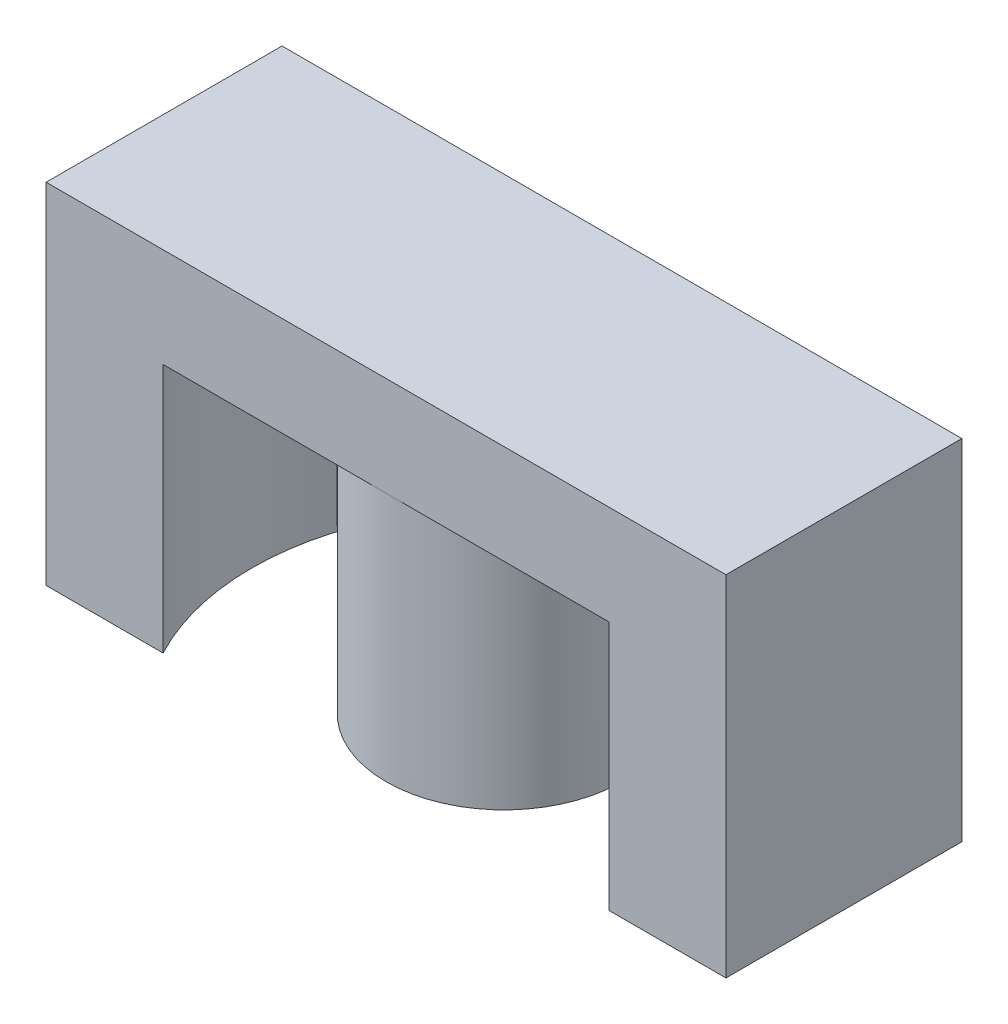
ISO-10303-21;
HEADER;
FILE_DESCRIPTION(('STEP AP214'),'2;1');
FILE_NAME('part.step','',(''),(''),'','','');
FILE_SCHEMA(('AUTOMOTIVE_DESIGN { 1 0 10303 214 1 1 1 1 }'));
ENDSEC;
DATA;
#1=APPLICATION_CONTEXT('core data for automotive mechanical design processes');
#2=APPLICATION_PROTOCOL_DEFINITION('international standard','automotive_design',2000,#1);
#3=PRODUCT_CONTEXT('',#1,'mechanical');
#4=PRODUCT('Part','Part','',(#3));
#5=PRODUCT_RELATED_PRODUCT_CATEGORY('part','',(#4));
#6=PRODUCT_DEFINITION_FORMATION('','',#4);
#7=PRODUCT_DEFINITION_CONTEXT('part definition',#1,'design');
#8=PRODUCT_DEFINITION('design','',#6,#7);
#9=PRODUCT_DEFINITION_SHAPE('','',#8);
#10=(LENGTH_UNIT() NAMED_UNIT(*) SI_UNIT(.MILLI.,.METRE.));
#11=(NAMED_UNIT(*) PLANE_ANGLE_UNIT() SI_UNIT($,.RADIAN.));
#12=(NAMED_UNIT(*) SI_UNIT($,.STERADIAN.) SOLID_ANGLE_UNIT());
#13=UNCERTAINTY_MEASURE_WITH_UNIT(LENGTH_MEASURE(1.E-05),#10,'distance_accuracy_value','');
#14=(GEOMETRIC_REPRESENTATION_CONTEXT(3) GLOBAL_UNCERTAINTY_ASSIGNED_CONTEXT((#13)) GLOBAL_UNIT_ASSIGNED_CONTEXT((#10,
#11,#12)) REPRESENTATION_CONTEXT('',''));
#15=CARTESIAN_POINT('',(0.,0.,0.));
#16=DIRECTION('',(0.,0.,1.));
#17=DIRECTION('',(1.,0.,0.));
#18=AXIS2_PLACEMENT_3D('',#15,#16,#17);
#19=CARTESIAN_POINT('',(0.,0.,22.4));
#20=DIRECTION('',(0.,1.,0.));
#21=DIRECTION('',(0.,0.,1.));
#22=AXIS2_PLACEMENT_3D('',#19,#20,#21);
#23=PLANE('',#22);
#24=CARTESIAN_POINT('',(0.,0.,22.4));
#25=DIRECTION('',(0.,1.,0.));
#26=DIRECTION('',(0.,0.,1.));
#27=AXIS2_PLACEMENT_3D('',#24,#25,#26);
#28=CIRCLE('',#27,7.6);
#29=CARTESIAN_POINT('',(0.,0.,30.));
#30=VERTEX_POINT('',#29);
#31=EDGE_CURVE('E20',#30,#30,#28,.T.);
#32=ORIENTED_EDGE('',*,*,#31,.F.);
#33=EDGE_LOOP('',(#32));
#34=FACE_BOUND('',#33,.T.);
#35=ADVANCED_FACE('F17',(#34),#23,.F.);
#36=CARTESIAN_POINT('',(0.,0.1,22.4));
#37=DIRECTION('',(0.,1.,0.));
#38=DIRECTION('',(0.,0.,1.));
#39=AXIS2_PLACEMENT_3D('',#36,#37,#38);
#40=CYLINDRICAL_SURFACE('',#39,7.6);
#41=ORIENTED_EDGE('',*,*,#31,.T.);
#42=EDGE_LOOP('',(#41));
#43=FACE_BOUND('',#42,.T.);
#44=CARTESIAN_POINT('',(0.,16.1,22.4));
#45=DIRECTION('',(0.,1.,0.));
#46=DIRECTION('',(0.,0.,1.));
#47=AXIS2_PLACEMENT_3D('',#44,#45,#46);
#48=CIRCLE('',#47,7.6);
#49=CARTESIAN_POINT('',(0.,16.1,14.8));
#50=VERTEX_POINT('',#49);
#51=CARTESIAN_POINT('',(0.,16.1,30.));
#52=VERTEX_POINT('',#51);
#53=EDGE_CURVE('E126',#50,#52,#48,.T.);
#54=ORIENTED_EDGE('',*,*,#53,.F.);
#55=CARTESIAN_POINT('',(0.,16.1,22.4));
#56=DIRECTION('',(0.,1.,0.));
#57=DIRECTION('',(0.,0.,1.));
#58=AXIS2_PLACEMENT_3D('',#55,#56,#57);
#59=CIRCLE('',#58,7.6);
#60=EDGE_CURVE('E128',#52,#50,#59,.T.);
#61=ORIENTED_EDGE('',*,*,#60,.F.);
#62=EDGE_LOOP('',(#54,#61));
#63=FACE_BOUND('',#62,.T.);
#64=ADVANCED_FACE('F197',(#43,#63),#40,.T.);
#65=CARTESIAN_POINT('',(0.,0.,22.4));
#66=DIRECTION('',(0.,1.,0.));
#67=DIRECTION('',(0.,0.,1.));
#68=AXIS2_PLACEMENT_3D('',#65,#66,#67);
#69=PLANE('',#68);
#70=DIRECTION('',(0.,0.,1.));
#71=VECTOR('',#70,1.);
#72=CARTESIAN_POINT('',(-21.9,0.,30.));
#73=LINE('',#72,#71);
#74=CARTESIAN_POINT('',(-21.9,0.,14.8));
#75=VERTEX_POINT('',#74);
#76=CARTESIAN_POINT('',(-21.9,0.,30.));
#77=VERTEX_POINT('',#76);
#78=EDGE_CURVE('E103',#75,#77,#73,.T.);
#79=ORIENTED_EDGE('',*,*,#78,.F.);
#80=DIRECTION('',(1.,0.,0.));
#81=VECTOR('',#80,1.);
#82=CARTESIAN_POINT('',(-21.9,0.,14.8));
#83=LINE('',#82,#81);
#84=CARTESIAN_POINT('',(-14.3632343154309,0.,14.8));
#85=VERTEX_POINT('',#84);
#86=EDGE_CURVE('E167',#85,#75,#83,.F.);
#87=ORIENTED_EDGE('',*,*,#86,.F.);
#88=CARTESIAN_POINT('',(0.,0.,22.4));
#89=DIRECTION('',(0.,1.,0.));
#90=DIRECTION('',(0.,0.,1.));
#91=AXIS2_PLACEMENT_3D('',#88,#89,#90);
#92=CIRCLE('',#91,16.25);
#93=CARTESIAN_POINT('',(-14.3632343154309,0.,30.));
#94=VERTEX_POINT('',#93);
#95=EDGE_CURVE('E112',#85,#94,#92,.T.);
#96=ORIENTED_EDGE('',*,*,#95,.T.);
#97=DIRECTION('',(1.,0.,0.));
#98=VECTOR('',#97,1.);
#99=CARTESIAN_POINT('',(-21.9,0.,30.));
#100=LINE('',#99,#98);
#101=EDGE_CURVE('E110',#77,#94,#100,.T.);
#102=ORIENTED_EDGE('',*,*,#101,.F.);
#103=EDGE_LOOP('',(#79,#87,#96,#102));
#104=FACE_BOUND('',#103,.T.);
#105=ADVANCED_FACE('F199',(#104),#69,.F.);
#106=CARTESIAN_POINT('',(0.,0.,22.4));
#107=DIRECTION('',(0.,1.,0.));
#108=DIRECTION('',(0.,0.,1.));
#109=AXIS2_PLACEMENT_3D('',#106,#107,#108);
#110=PLANE('',#109);
#111=DIRECTION('',(0.,0.,-1.));
#112=VECTOR('',#111,1.);
#113=CARTESIAN_POINT('',(21.9,0.,30.));
#114=LINE('',#113,#112);
#115=CARTESIAN_POINT('',(21.9,0.,30.));
#116=VERTEX_POINT('',#115);
#117=CARTESIAN_POINT('',(21.9,0.,14.8));
#118=VERTEX_POINT('',#117);
#119=EDGE_CURVE('E106',#116,#118,#114,.T.);
#120=ORIENTED_EDGE('',*,*,#119,.F.);
#121=DIRECTION('',(1.,0.,0.));
#122=VECTOR('',#121,1.);
#123=CARTESIAN_POINT('',(-21.9,0.,30.));
#124=LINE('',#123,#122);
#125=CARTESIAN_POINT('',(14.3632343154319,0.,30.));
#126=VERTEX_POINT('',#125);
#127=EDGE_CURVE('E98',#126,#116,#124,.T.);
#128=ORIENTED_EDGE('',*,*,#127,.F.);
#129=CARTESIAN_POINT('',(0.,0.,22.4));
#130=DIRECTION('',(0.,1.,0.));
#131=DIRECTION('',(0.,0.,1.));
#132=AXIS2_PLACEMENT_3D('',#129,#130,#131);
#133=CIRCLE('',#132,16.25);
#134=CARTESIAN_POINT('',(14.3632343154319,0.,14.8));
#135=VERTEX_POINT('',#134);
#136=EDGE_CURVE('E85',#126,#135,#133,.T.);
#137=ORIENTED_EDGE('',*,*,#136,.T.);
#138=DIRECTION('',(1.,0.,0.));
#139=VECTOR('',#138,1.);
#140=CARTESIAN_POINT('',(-21.9,0.,14.8));
#141=LINE('',#140,#139);
#142=EDGE_CURVE('E141',#118,#135,#141,.F.);
#143=ORIENTED_EDGE('',*,*,#142,.F.);
#144=EDGE_LOOP('',(#120,#128,#137,#143));
#145=FACE_BOUND('',#144,.T.);
#146=ADVANCED_FACE('F105',(#145),#110,.F.);
#147=CARTESIAN_POINT('',(0.,0.,22.4));
#148=DIRECTION('',(0.,1.,0.));
#149=DIRECTION('',(0.,0.,1.));
#150=AXIS2_PLACEMENT_3D('',#147,#148,#149);
#151=CYLINDRICAL_SURFACE('',#150,16.25);
#152=ORIENTED_EDGE('',*,*,#136,.F.);
#153=DIRECTION('',(0.,-1.,0.));
#154=VECTOR('',#153,1.);
#155=CARTESIAN_POINT('',(14.363234315432,16.1,30.));
#156=LINE('',#155,#154);
#157=CARTESIAN_POINT('',(14.3632343154319,16.1,30.));
#158=VERTEX_POINT('',#157);
#159=EDGE_CURVE('E89',#158,#126,#156,.T.);
#160=ORIENTED_EDGE('',*,*,#159,.F.);
#161=CARTESIAN_POINT('',(0.,16.1,22.4));
#162=DIRECTION('',(0.,1.,0.));
#163=DIRECTION('',(0.,0.,1.));
#164=AXIS2_PLACEMENT_3D('',#161,#162,#163);
#165=CIRCLE('',#164,16.25);
#166=CARTESIAN_POINT('',(14.3632343154319,16.1,14.8));
#167=VERTEX_POINT('',#166);
#168=EDGE_CURVE('E94',#167,#158,#165,.F.);
#169=ORIENTED_EDGE('',*,*,#168,.F.);
#170=DIRECTION('',(0.,1.,0.));
#171=VECTOR('',#170,1.);
#172=CARTESIAN_POINT('',(14.363234315432,16.1,14.8));
#173=LINE('',#172,#171);
#174=EDGE_CURVE('E90',#135,#167,#173,.T.);
#175=ORIENTED_EDGE('',*,*,#174,.F.);
#176=EDGE_LOOP('',(#152,#160,#169,#175));
#177=FACE_BOUND('',#176,.T.);
#178=ADVANCED_FACE('F87',(#177),#151,.F.);
#179=CARTESIAN_POINT('',(21.9,16.1,14.8));
#180=DIRECTION('',(0.,-1.,0.));
#181=DIRECTION('',(0.,0.,-1.));
#182=AXIS2_PLACEMENT_3D('',#179,#180,#181);
#183=PLANE('',#182);
#184=ORIENTED_EDGE('',*,*,#60,.T.);
#185=DIRECTION('',(1.,0.,0.));
#186=VECTOR('',#185,1.);
#187=CARTESIAN_POINT('',(-21.9,16.1,14.8));
#188=LINE('',#187,#186);
#189=EDGE_CURVE('E134',#167,#50,#188,.F.);
#190=ORIENTED_EDGE('',*,*,#189,.F.);
#191=ORIENTED_EDGE('',*,*,#168,.T.);
#192=DIRECTION('',(1.,0.,0.));
#193=VECTOR('',#192,1.);
#194=CARTESIAN_POINT('',(-21.9,16.1,30.));
#195=LINE('',#194,#193);
#196=EDGE_CURVE('E102',#52,#158,#195,.T.);
#197=ORIENTED_EDGE('',*,*,#196,.F.);
#198=EDGE_LOOP('',(#184,#190,#191,#197));
#199=FACE_BOUND('',#198,.T.);
#200=ADVANCED_FACE('F132',(#199),#183,.T.);
#201=CARTESIAN_POINT('',(21.9,16.1,14.8));
#202=DIRECTION('',(0.,-1.,0.));
#203=DIRECTION('',(0.,0.,-1.));
#204=AXIS2_PLACEMENT_3D('',#201,#202,#203);
#205=PLANE('',#204);
#206=ORIENTED_EDGE('',*,*,#53,.T.);
#207=DIRECTION('',(1.,0.,0.));
#208=VECTOR('',#207,1.);
#209=CARTESIAN_POINT('',(-21.9,16.1,30.));
#210=LINE('',#209,#208);
#211=CARTESIAN_POINT('',(-14.3632343154309,16.1,30.));
#212=VERTEX_POINT('',#211);
#213=EDGE_CURVE('E184',#212,#52,#210,.T.);
#214=ORIENTED_EDGE('',*,*,#213,.F.);
#215=CARTESIAN_POINT('',(0.,16.1,22.4));
#216=DIRECTION('',(0.,1.,0.));
#217=DIRECTION('',(0.,0.,1.));
#218=AXIS2_PLACEMENT_3D('',#215,#216,#217);
#219=CIRCLE('',#218,16.25);
#220=CARTESIAN_POINT('',(-14.3632343154309,16.1,14.8));
#221=VERTEX_POINT('',#220);
#222=EDGE_CURVE('E123',#212,#221,#219,.F.);
#223=ORIENTED_EDGE('',*,*,#222,.T.);
#224=DIRECTION('',(1.,0.,0.));
#225=VECTOR('',#224,1.);
#226=CARTESIAN_POINT('',(-21.9,16.1,14.8));
#227=LINE('',#226,#225);
#228=EDGE_CURVE('E137',#50,#221,#227,.F.);
#229=ORIENTED_EDGE('',*,*,#228,.F.);
#230=EDGE_LOOP('',(#206,#214,#223,#229));
#231=FACE_BOUND('',#230,.T.);
#232=ADVANCED_FACE('F193',(#231),#205,.T.);
#233=CARTESIAN_POINT('',(0.,0.,22.4));
#234=DIRECTION('',(0.,1.,0.));
#235=DIRECTION('',(0.,0.,1.));
#236=AXIS2_PLACEMENT_3D('',#233,#234,#235);
#237=CYLINDRICAL_SURFACE('',#236,16.25);
#238=ORIENTED_EDGE('',*,*,#95,.F.);
#239=DIRECTION('',(0.,1.,0.));
#240=VECTOR('',#239,1.);
#241=CARTESIAN_POINT('',(-14.36323431543,16.1,14.8));
#242=LINE('',#241,#240);
#243=EDGE_CURVE('E139',#221,#85,#242,.F.);
#244=ORIENTED_EDGE('',*,*,#243,.F.);
#245=ORIENTED_EDGE('',*,*,#222,.F.);
#246=DIRECTION('',(0.,-1.,0.));
#247=VECTOR('',#246,1.);
#248=CARTESIAN_POINT('',(-14.36323431543,16.1,30.));
#249=LINE('',#248,#247);
#250=EDGE_CURVE('E116',#94,#212,#249,.F.);
#251=ORIENTED_EDGE('',*,*,#250,.F.);
#252=EDGE_LOOP('',(#238,#244,#245,#251));
#253=FACE_BOUND('',#252,.T.);
#254=ADVANCED_FACE('F230',(#253),#237,.F.);
#255=CARTESIAN_POINT('',(21.9,16.1,30.));
#256=DIRECTION('',(1.,0.,0.));
#257=DIRECTION('',(0.,0.,-1.));
#258=AXIS2_PLACEMENT_3D('',#255,#256,#257);
#259=PLANE('',#258);
#260=DIRECTION('',(0.,0.,-1.));
#261=VECTOR('',#260,1.);
#262=CARTESIAN_POINT('',(21.9,22.5,14.8));
#263=LINE('',#262,#261);
#264=CARTESIAN_POINT('',(21.9,22.5,14.8));
#265=VERTEX_POINT('',#264);
#266=CARTESIAN_POINT('',(21.9,22.5,30.));
#267=VERTEX_POINT('',#266);
#268=EDGE_CURVE('E148',#265,#267,#263,.F.);
#269=ORIENTED_EDGE('',*,*,#268,.T.);
#270=DIRECTION('',(0.,-1.,0.));
#271=VECTOR('',#270,1.);
#272=CARTESIAN_POINT('',(21.9,16.1,30.));
#273=LINE('',#272,#271);
#274=EDGE_CURVE('E108',#116,#267,#273,.F.);
#275=ORIENTED_EDGE('',*,*,#274,.F.);
#276=ORIENTED_EDGE('',*,*,#119,.T.);
#277=DIRECTION('',(0.,1.,0.));
#278=VECTOR('',#277,1.);
#279=CARTESIAN_POINT('',(21.9,16.1,14.8));
#280=LINE('',#279,#278);
#281=EDGE_CURVE('E152',#265,#118,#280,.F.);
#282=ORIENTED_EDGE('',*,*,#281,.F.);
#283=EDGE_LOOP('',(#269,#275,#276,#282));
#284=FACE_BOUND('',#283,.T.);
#285=ADVANCED_FACE('F227',(#284),#259,.T.);
#286=CARTESIAN_POINT('',(-21.9,16.1,30.));
#287=DIRECTION('',(0.,0.,1.));
#288=DIRECTION('',(0.,-1.,0.));
#289=AXIS2_PLACEMENT_3D('',#286,#287,#288);
#290=PLANE('',#289);
#291=ORIENTED_EDGE('',*,*,#196,.T.);
#292=ORIENTED_EDGE('',*,*,#159,.T.);
#293=ORIENTED_EDGE('',*,*,#127,.T.);
#294=ORIENTED_EDGE('',*,*,#274,.T.);
#295=DIRECTION('',(1.,0.,0.));
#296=VECTOR('',#295,1.);
#297=CARTESIAN_POINT('',(21.9,22.5,30.));
#298=LINE('',#297,#296);
#299=CARTESIAN_POINT('',(-21.9,22.5,30.));
#300=VERTEX_POINT('',#299);
#301=EDGE_CURVE('E144',#267,#300,#298,.F.);
#302=ORIENTED_EDGE('',*,*,#301,.T.);
#303=DIRECTION('',(0.,1.,0.));
#304=VECTOR('',#303,1.);
#305=CARTESIAN_POINT('',(-21.9,16.1,30.));
#306=LINE('',#305,#304);
#307=EDGE_CURVE('E169',#77,#300,#306,.T.);
#308=ORIENTED_EDGE('',*,*,#307,.F.);
#309=ORIENTED_EDGE('',*,*,#101,.T.);
#310=ORIENTED_EDGE('',*,*,#250,.T.);
#311=ORIENTED_EDGE('',*,*,#213,.T.);
#312=EDGE_LOOP('',(#291,#292,#293,#294,#302,#308,#309,#310,#311));
#313=FACE_BOUND('',#312,.T.);
#314=ADVANCED_FACE('F97',(#313),#290,.T.);
#315=CARTESIAN_POINT('',(-21.9,16.1,30.));
#316=DIRECTION('',(-1.,0.,0.));
#317=DIRECTION('',(0.,0.,1.));
#318=AXIS2_PLACEMENT_3D('',#315,#316,#317);
#319=PLANE('',#318);
#320=DIRECTION('',(0.,0.,-1.));
#321=VECTOR('',#320,1.);
#322=CARTESIAN_POINT('',(-21.9,22.5,14.8));
#323=LINE('',#322,#321);
#324=CARTESIAN_POINT('',(-21.9,22.5,14.8));
#325=VERTEX_POINT('',#324);
#326=EDGE_CURVE('E26',#300,#325,#323,.T.);
#327=ORIENTED_EDGE('',*,*,#326,.T.);
#328=DIRECTION('',(0.,1.,0.));
#329=VECTOR('',#328,1.);
#330=CARTESIAN_POINT('',(-21.9,16.1,14.8));
#331=LINE('',#330,#329);
#332=EDGE_CURVE('E34',#75,#325,#331,.T.);
#333=ORIENTED_EDGE('',*,*,#332,.F.);
#334=ORIENTED_EDGE('',*,*,#78,.T.);
#335=ORIENTED_EDGE('',*,*,#307,.T.);
#336=EDGE_LOOP('',(#327,#333,#334,#335));
#337=FACE_BOUND('',#336,.T.);
#338=ADVANCED_FACE('F218',(#337),#319,.T.);
#339=CARTESIAN_POINT('',(-21.9,16.1,14.8));
#340=DIRECTION('',(0.,0.,-1.));
#341=DIRECTION('',(0.,1.,0.));
#342=AXIS2_PLACEMENT_3D('',#339,#340,#341);
#343=PLANE('',#342);
#344=ORIENTED_EDGE('',*,*,#228,.T.);
#345=ORIENTED_EDGE('',*,*,#243,.T.);
#346=ORIENTED_EDGE('',*,*,#86,.T.);
#347=ORIENTED_EDGE('',*,*,#332,.T.);
#348=DIRECTION('',(1.,0.,0.));
#349=VECTOR('',#348,1.);
#350=CARTESIAN_POINT('',(21.9,22.5,14.8));
#351=LINE('',#350,#349);
#352=EDGE_CURVE('E11',#325,#265,#351,.T.);
#353=ORIENTED_EDGE('',*,*,#352,.T.);
#354=ORIENTED_EDGE('',*,*,#281,.T.);
#355=ORIENTED_EDGE('',*,*,#142,.T.);
#356=ORIENTED_EDGE('',*,*,#174,.T.);
#357=ORIENTED_EDGE('',*,*,#189,.T.);
#358=EDGE_LOOP('',(#344,#345,#346,#347,#353,#354,#355,#356,#357));
#359=FACE_BOUND('',#358,.T.);
#360=ADVANCED_FACE('F212',(#359),#343,.T.);
#361=CARTESIAN_POINT('',(21.9,22.5,14.8));
#362=DIRECTION('',(0.,-1.,0.));
#363=DIRECTION('',(0.,0.,-1.));
#364=AXIS2_PLACEMENT_3D('',#361,#362,#363);
#365=PLANE('',#364);
#366=ORIENTED_EDGE('',*,*,#326,.F.);
#367=ORIENTED_EDGE('',*,*,#301,.F.);
#368=ORIENTED_EDGE('',*,*,#268,.F.);
#369=ORIENTED_EDGE('',*,*,#352,.F.);
#370=EDGE_LOOP('',(#366,#367,#368,#369));
#371=FACE_BOUND('',#370,.T.);
#372=ADVANCED_FACE('F210',(#371),#365,.F.);
#373=CLOSED_SHELL('',(#35,#64,#105,#146,#178,#200,#232,#254,#285,#314,#338,#360,#372));
#374=MANIFOLD_SOLID_BREP('B1',#373);
#375=ADVANCED_BREP_SHAPE_REPRESENTATION('',(#18,#374),#14);
#376=SHAPE_DEFINITION_REPRESENTATION(#9,#375);
ENDSEC;
END-ISO-10303-21;
